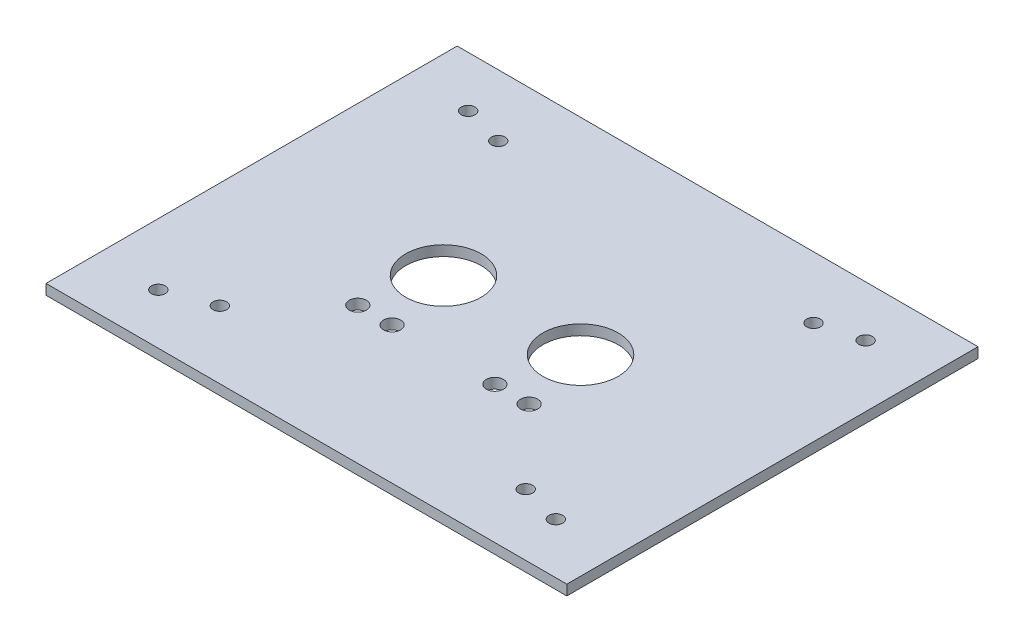
ISO-10303-21;
HEADER;
FILE_DESCRIPTION(('STEP AP214'),'2;1');
FILE_NAME('part.step','',(''),(''),'','','');
FILE_SCHEMA(('AUTOMOTIVE_DESIGN { 1 0 10303 214 1 1 1 1 }'));
ENDSEC;
DATA;
#1=APPLICATION_CONTEXT('core data for automotive mechanical design processes');
#2=APPLICATION_PROTOCOL_DEFINITION('international standard','automotive_design',2000,#1);
#3=PRODUCT_CONTEXT('',#1,'mechanical');
#4=PRODUCT('Part','Part','',(#3));
#5=PRODUCT_RELATED_PRODUCT_CATEGORY('part','',(#4));
#6=PRODUCT_DEFINITION_FORMATION('','',#4);
#7=PRODUCT_DEFINITION_CONTEXT('part definition',#1,'design');
#8=PRODUCT_DEFINITION('design','',#6,#7);
#9=PRODUCT_DEFINITION_SHAPE('','',#8);
#10=(LENGTH_UNIT() NAMED_UNIT(*) SI_UNIT(.MILLI.,.METRE.));
#11=(NAMED_UNIT(*) PLANE_ANGLE_UNIT() SI_UNIT($,.RADIAN.));
#12=(NAMED_UNIT(*) SI_UNIT($,.STERADIAN.) SOLID_ANGLE_UNIT());
#13=UNCERTAINTY_MEASURE_WITH_UNIT(LENGTH_MEASURE(1.E-05),#10,'distance_accuracy_value','');
#14=(GEOMETRIC_REPRESENTATION_CONTEXT(3) GLOBAL_UNCERTAINTY_ASSIGNED_CONTEXT((#13)) GLOBAL_UNIT_ASSIGNED_CONTEXT((#10,
#11,#12)) REPRESENTATION_CONTEXT('',''));
#15=CARTESIAN_POINT('',(0.,0.,0.));
#16=DIRECTION('',(0.,0.,1.));
#17=DIRECTION('',(1.,0.,0.));
#18=AXIS2_PLACEMENT_3D('',#15,#16,#17);
#19=CARTESIAN_POINT('',(-26.6885438978218,3.,22.2049050632911));
#20=DIRECTION('',(0.,1.,0.));
#21=DIRECTION('',(0.,0.,1.));
#22=AXIS2_PLACEMENT_3D('',#19,#20,#21);
#23=PLANE('',#22);
#24=CARTESIAN_POINT('',(107.311456102178,3.,7.40694609215854));
#25=DIRECTION('',(0.,-1.,0.));
#26=DIRECTION('',(0.,0.,-1.));
#27=AXIS2_PLACEMENT_3D('',#24,#25,#26);
#28=CIRCLE('',#27,2.);
#29=CARTESIAN_POINT('',(107.311456102178,3.,5.40694609215854));
#30=VERTEX_POINT('',#29);
#31=EDGE_CURVE('E186',#30,#30,#28,.T.);
#32=ORIENTED_EDGE('',*,*,#31,.T.);
#33=EDGE_LOOP('',(#32));
#34=FACE_BOUND('',#33,.T.);
#35=CARTESIAN_POINT('',(-8.68854389782176,3.,7.40694609215852));
#36=DIRECTION('',(0.,-1.,0.));
#37=DIRECTION('',(0.,0.,-1.));
#38=AXIS2_PLACEMENT_3D('',#35,#36,#37);
#39=CIRCLE('',#38,2.);
#40=CARTESIAN_POINT('',(-8.68854389782176,3.,5.40694609215852));
#41=VERTEX_POINT('',#40);
#42=EDGE_CURVE('E180',#41,#41,#39,.T.);
#43=ORIENTED_EDGE('',*,*,#42,.T.);
#44=EDGE_LOOP('',(#43));
#45=FACE_BOUND('',#44,.T.);
#46=CARTESIAN_POINT('',(107.311456102178,3.,-82.9971359655761));
#47=DIRECTION('',(0.,-1.,0.));
#48=DIRECTION('',(0.,0.,-1.));
#49=AXIS2_PLACEMENT_3D('',#46,#47,#48);
#50=CIRCLE('',#49,2.0000000000001);
#51=CARTESIAN_POINT('',(107.311456102178,3.,-84.9971359655762));
#52=VERTEX_POINT('',#51);
#53=EDGE_CURVE('E174',#52,#52,#50,.T.);
#54=ORIENTED_EDGE('',*,*,#53,.T.);
#55=EDGE_LOOP('',(#54));
#56=FACE_BOUND('',#55,.T.);
#57=CARTESIAN_POINT('',(95.3114561021782,3.,4.20490506329116));
#58=DIRECTION('',(0.,-1.,0.));
#59=DIRECTION('',(0.,0.,-1.));
#60=AXIS2_PLACEMENT_3D('',#57,#58,#59);
#61=CIRCLE('',#60,2.);
#62=CARTESIAN_POINT('',(95.3114561021782,3.,2.20490506329117));
#63=VERTEX_POINT('',#62);
#64=EDGE_CURVE('E168',#63,#63,#61,.T.);
#65=ORIENTED_EDGE('',*,*,#64,.T.);
#66=EDGE_LOOP('',(#65));
#67=FACE_BOUND('',#66,.T.);
#68=CARTESIAN_POINT('',(-8.68854389782176,3.,-82.997135965576));
#69=DIRECTION('',(0.,-1.,0.));
#70=DIRECTION('',(0.,0.,-1.));
#71=AXIS2_PLACEMENT_3D('',#68,#69,#70);
#72=CIRCLE('',#71,2.);
#73=CARTESIAN_POINT('',(-8.68854389782176,3.,-84.997135965576));
#74=VERTEX_POINT('',#73);
#75=EDGE_CURVE('E162',#74,#74,#72,.T.);
#76=ORIENTED_EDGE('',*,*,#75,.T.);
#77=EDGE_LOOP('',(#76));
#78=FACE_BOUND('',#77,.T.);
#79=CARTESIAN_POINT('',(3.31145610217824,3.,-79.7950949367089));
#80=DIRECTION('',(0.,-1.,0.));
#81=DIRECTION('',(0.,0.,-1.));
#82=AXIS2_PLACEMENT_3D('',#79,#80,#81);
#83=CIRCLE('',#82,2.);
#84=CARTESIAN_POINT('',(3.31145610217824,3.,-81.7950949367089));
#85=VERTEX_POINT('',#84);
#86=EDGE_CURVE('E156',#85,#85,#83,.T.);
#87=ORIENTED_EDGE('',*,*,#86,.T.);
#88=EDGE_LOOP('',(#87));
#89=FACE_BOUND('',#88,.T.);
#90=CARTESIAN_POINT('',(95.3114561021782,3.,-79.7950949367088));
#91=DIRECTION('',(0.,-1.,0.));
#92=DIRECTION('',(0.,0.,-1.));
#93=AXIS2_PLACEMENT_3D('',#90,#91,#92);
#94=CIRCLE('',#93,2.);
#95=CARTESIAN_POINT('',(95.3114561021782,3.,-81.7950949367088));
#96=VERTEX_POINT('',#95);
#97=EDGE_CURVE('E150',#96,#96,#94,.T.);
#98=ORIENTED_EDGE('',*,*,#97,.T.);
#99=EDGE_LOOP('',(#98));
#100=FACE_BOUND('',#99,.T.);
#101=CARTESIAN_POINT('',(4.32784020325498,3.,2.48241751353112));
#102=DIRECTION('',(0.,-1.,0.));
#103=DIRECTION('',(0.,0.,-1.));
#104=AXIS2_PLACEMENT_3D('',#101,#102,#103);
#105=CIRCLE('',#104,2.);
#106=CARTESIAN_POINT('',(4.32784020325498,3.,0.482417513531124));
#107=VERTEX_POINT('',#106);
#108=EDGE_CURVE('E144',#107,#107,#105,.T.);
#109=ORIENTED_EDGE('',*,*,#108,.T.);
#110=EDGE_LOOP('',(#109));
#111=FACE_BOUND('',#110,.T.);
#112=CARTESIAN_POINT('',(29.3114561021782,3.,-37.7950949367089));
#113=DIRECTION('',(0.,1.,0.));
#114=DIRECTION('',(0.,0.,1.));
#115=AXIS2_PLACEMENT_3D('',#112,#113,#114);
#116=CIRCLE('',#115,11.);
#117=CARTESIAN_POINT('',(29.3114561021782,3.,-26.7950949367089));
#118=VERTEX_POINT('',#117);
#119=EDGE_CURVE('E132',#118,#118,#116,.T.);
#120=ORIENTED_EDGE('',*,*,#119,.F.);
#121=EDGE_LOOP('',(#120));
#122=FACE_BOUND('',#121,.T.);
#123=CARTESIAN_POINT('',(64.3114561021782,3.,-17.7950949367089));
#124=DIRECTION('',(0.,1.,0.));
#125=DIRECTION('',(0.,0.,1.));
#126=AXIS2_PLACEMENT_3D('',#123,#124,#125);
#127=CIRCLE('',#126,2.49999999999999);
#128=CARTESIAN_POINT('',(64.3114561021782,3.,-15.2950949367089));
#129=VERTEX_POINT('',#128);
#130=EDGE_CURVE('E120',#129,#129,#127,.T.);
#131=ORIENTED_EDGE('',*,*,#130,.F.);
#132=EDGE_LOOP('',(#131));
#133=FACE_BOUND('',#132,.T.);
#134=CARTESIAN_POINT('',(24.3114561021782,3.,-17.7950949367089));
#135=DIRECTION('',(0.,1.,0.));
#136=DIRECTION('',(0.,0.,1.));
#137=AXIS2_PLACEMENT_3D('',#134,#135,#136);
#138=CIRCLE('',#137,2.5);
#139=CARTESIAN_POINT('',(24.3114561021782,3.,-15.2950949367089));
#140=VERTEX_POINT('',#139);
#141=EDGE_CURVE('E99',#140,#140,#138,.T.);
#142=ORIENTED_EDGE('',*,*,#141,.F.);
#143=EDGE_LOOP('',(#142));
#144=FACE_BOUND('',#143,.T.);
#145=DIRECTION('',(0.,0.,1.));
#146=VECTOR('',#145,1.);
#147=CARTESIAN_POINT('',(-26.6885438978218,3.,-97.7950949367089));
#148=LINE('',#147,#146);
#149=CARTESIAN_POINT('',(-26.6885438978218,3.,-97.7950949367089));
#150=VERTEX_POINT('',#149);
#151=CARTESIAN_POINT('',(-26.6885438978218,3.,22.2049050632911));
#152=VERTEX_POINT('',#151);
#153=EDGE_CURVE('E84',#150,#152,#148,.T.);
#154=ORIENTED_EDGE('',*,*,#153,.T.);
#155=DIRECTION('',(1.,0.,0.));
#156=VECTOR('',#155,1.);
#157=CARTESIAN_POINT('',(-26.6885438978218,3.,22.2049050632911));
#158=LINE('',#157,#156);
#159=CARTESIAN_POINT('',(125.311456102178,3.,22.2049050632911));
#160=VERTEX_POINT('',#159);
#161=EDGE_CURVE('E79',#152,#160,#158,.T.);
#162=ORIENTED_EDGE('',*,*,#161,.T.);
#163=DIRECTION('',(0.,0.,-1.));
#164=VECTOR('',#163,1.);
#165=CARTESIAN_POINT('',(125.311456102178,3.,-97.7950949367089));
#166=LINE('',#165,#164);
#167=CARTESIAN_POINT('',(125.311456102178,3.,-97.7950949367089));
#168=VERTEX_POINT('',#167);
#169=EDGE_CURVE('E82',#160,#168,#166,.T.);
#170=ORIENTED_EDGE('',*,*,#169,.T.);
#171=DIRECTION('',(-1.,0.,0.));
#172=VECTOR('',#171,1.);
#173=CARTESIAN_POINT('',(-26.6885438978218,3.,-97.7950949367089));
#174=LINE('',#173,#172);
#175=EDGE_CURVE('E49',#168,#150,#174,.T.);
#176=ORIENTED_EDGE('',*,*,#175,.T.);
#177=EDGE_LOOP('',(#154,#162,#170,#176));
#178=FACE_BOUND('',#177,.T.);
#179=CARTESIAN_POINT('',(34.3114561021782,3.,-17.7950949367089));
#180=DIRECTION('',(0.,1.,0.));
#181=DIRECTION('',(0.,0.,1.));
#182=AXIS2_PLACEMENT_3D('',#179,#180,#181);
#183=CIRCLE('',#182,2.49999999999999);
#184=CARTESIAN_POINT('',(34.3114561021782,3.,-15.2950949367089));
#185=VERTEX_POINT('',#184);
#186=EDGE_CURVE('E114',#185,#185,#183,.T.);
#187=ORIENTED_EDGE('',*,*,#186,.F.);
#188=EDGE_LOOP('',(#187));
#189=FACE_BOUND('',#188,.T.);
#190=CARTESIAN_POINT('',(74.3114561021782,3.,-17.7950949367089));
#191=DIRECTION('',(0.,1.,0.));
#192=DIRECTION('',(0.,0.,1.));
#193=AXIS2_PLACEMENT_3D('',#190,#191,#192);
#194=CIRCLE('',#193,2.49999999999999);
#195=CARTESIAN_POINT('',(74.3114561021782,3.,-15.2950949367089));
#196=VERTEX_POINT('',#195);
#197=EDGE_CURVE('E126',#196,#196,#194,.T.);
#198=ORIENTED_EDGE('',*,*,#197,.F.);
#199=EDGE_LOOP('',(#198));
#200=FACE_BOUND('',#199,.T.);
#201=CARTESIAN_POINT('',(69.3114561021782,3.,-37.7950949367089));
#202=DIRECTION('',(0.,1.,0.));
#203=DIRECTION('',(0.,0.,1.));
#204=AXIS2_PLACEMENT_3D('',#201,#202,#203);
#205=CIRCLE('',#204,11.);
#206=CARTESIAN_POINT('',(69.3114561021782,3.,-26.7950949367089));
#207=VERTEX_POINT('',#206);
#208=EDGE_CURVE('E138',#207,#207,#205,.T.);
#209=ORIENTED_EDGE('',*,*,#208,.F.);
#210=EDGE_LOOP('',(#209));
#211=FACE_BOUND('',#210,.T.);
#212=ADVANCED_FACE('F32',(#34,#45,#56,#67,#78,#89,#100,#111,#122,#133,#144,#178,#189,#200,#211),
#23,.T.);
#213=CARTESIAN_POINT('',(-26.6885438978218,0.,22.2049050632911));
#214=DIRECTION('',(0.,1.,0.));
#215=DIRECTION('',(0.,0.,1.));
#216=AXIS2_PLACEMENT_3D('',#213,#214,#215);
#217=PLANE('',#216);
#218=CARTESIAN_POINT('',(107.311456102178,0.,7.40694609215854));
#219=DIRECTION('',(0.,-1.,0.));
#220=DIRECTION('',(0.,0.,-1.));
#221=AXIS2_PLACEMENT_3D('',#218,#219,#220);
#222=CIRCLE('',#221,2.);
#223=CARTESIAN_POINT('',(107.311456102178,0.,5.40694609215854));
#224=VERTEX_POINT('',#223);
#225=EDGE_CURVE('E189',#224,#224,#222,.T.);
#226=ORIENTED_EDGE('',*,*,#225,.F.);
#227=EDGE_LOOP('',(#226));
#228=FACE_BOUND('',#227,.T.);
#229=CARTESIAN_POINT('',(-8.68854389782176,0.,7.40694609215852));
#230=DIRECTION('',(0.,-1.,0.));
#231=DIRECTION('',(0.,0.,-1.));
#232=AXIS2_PLACEMENT_3D('',#229,#230,#231);
#233=CIRCLE('',#232,2.);
#234=CARTESIAN_POINT('',(-8.68854389782176,0.,5.40694609215852));
#235=VERTEX_POINT('',#234);
#236=EDGE_CURVE('E183',#235,#235,#233,.T.);
#237=ORIENTED_EDGE('',*,*,#236,.F.);
#238=EDGE_LOOP('',(#237));
#239=FACE_BOUND('',#238,.T.);
#240=CARTESIAN_POINT('',(107.311456102178,0.,-82.9971359655761));
#241=DIRECTION('',(0.,-1.,0.));
#242=DIRECTION('',(0.,0.,-1.));
#243=AXIS2_PLACEMENT_3D('',#240,#241,#242);
#244=CIRCLE('',#243,2.0000000000001);
#245=CARTESIAN_POINT('',(107.311456102178,0.,-84.9971359655762));
#246=VERTEX_POINT('',#245);
#247=EDGE_CURVE('E177',#246,#246,#244,.T.);
#248=ORIENTED_EDGE('',*,*,#247,.F.);
#249=EDGE_LOOP('',(#248));
#250=FACE_BOUND('',#249,.T.);
#251=CARTESIAN_POINT('',(95.3114561021782,0.,4.20490506329116));
#252=DIRECTION('',(0.,-1.,0.));
#253=DIRECTION('',(0.,0.,-1.));
#254=AXIS2_PLACEMENT_3D('',#251,#252,#253);
#255=CIRCLE('',#254,2.);
#256=CARTESIAN_POINT('',(95.3114561021782,0.,2.20490506329117));
#257=VERTEX_POINT('',#256);
#258=EDGE_CURVE('E171',#257,#257,#255,.T.);
#259=ORIENTED_EDGE('',*,*,#258,.F.);
#260=EDGE_LOOP('',(#259));
#261=FACE_BOUND('',#260,.T.);
#262=CARTESIAN_POINT('',(-8.68854389782176,0.,-82.997135965576));
#263=DIRECTION('',(0.,-1.,0.));
#264=DIRECTION('',(0.,0.,-1.));
#265=AXIS2_PLACEMENT_3D('',#262,#263,#264);
#266=CIRCLE('',#265,2.);
#267=CARTESIAN_POINT('',(-8.68854389782176,0.,-84.997135965576));
#268=VERTEX_POINT('',#267);
#269=EDGE_CURVE('E165',#268,#268,#266,.T.);
#270=ORIENTED_EDGE('',*,*,#269,.F.);
#271=EDGE_LOOP('',(#270));
#272=FACE_BOUND('',#271,.T.);
#273=CARTESIAN_POINT('',(3.31145610217824,0.,-79.7950949367089));
#274=DIRECTION('',(0.,-1.,0.));
#275=DIRECTION('',(0.,0.,-1.));
#276=AXIS2_PLACEMENT_3D('',#273,#274,#275);
#277=CIRCLE('',#276,2.);
#278=CARTESIAN_POINT('',(3.31145610217824,0.,-81.7950949367089));
#279=VERTEX_POINT('',#278);
#280=EDGE_CURVE('E159',#279,#279,#277,.T.);
#281=ORIENTED_EDGE('',*,*,#280,.F.);
#282=EDGE_LOOP('',(#281));
#283=FACE_BOUND('',#282,.T.);
#284=CARTESIAN_POINT('',(95.3114561021782,0.,-79.7950949367088));
#285=DIRECTION('',(0.,-1.,0.));
#286=DIRECTION('',(0.,0.,-1.));
#287=AXIS2_PLACEMENT_3D('',#284,#285,#286);
#288=CIRCLE('',#287,2.);
#289=CARTESIAN_POINT('',(95.3114561021782,0.,-81.7950949367088));
#290=VERTEX_POINT('',#289);
#291=EDGE_CURVE('E153',#290,#290,#288,.T.);
#292=ORIENTED_EDGE('',*,*,#291,.F.);
#293=EDGE_LOOP('',(#292));
#294=FACE_BOUND('',#293,.T.);
#295=CARTESIAN_POINT('',(4.32784020325498,0.,2.48241751353112));
#296=DIRECTION('',(0.,-1.,0.));
#297=DIRECTION('',(0.,0.,-1.));
#298=AXIS2_PLACEMENT_3D('',#295,#296,#297);
#299=CIRCLE('',#298,2.);
#300=CARTESIAN_POINT('',(4.32784020325498,0.,0.482417513531124));
#301=VERTEX_POINT('',#300);
#302=EDGE_CURVE('E147',#301,#301,#299,.T.);
#303=ORIENTED_EDGE('',*,*,#302,.F.);
#304=EDGE_LOOP('',(#303));
#305=FACE_BOUND('',#304,.T.);
#306=CARTESIAN_POINT('',(29.3114561021782,0.,-37.7950949367089));
#307=DIRECTION('',(0.,1.,0.));
#308=DIRECTION('',(0.,0.,1.));
#309=AXIS2_PLACEMENT_3D('',#306,#307,#308);
#310=CIRCLE('',#309,11.);
#311=CARTESIAN_POINT('',(29.3114561021782,0.,-26.7950949367089));
#312=VERTEX_POINT('',#311);
#313=EDGE_CURVE('E135',#312,#312,#310,.T.);
#314=ORIENTED_EDGE('',*,*,#313,.T.);
#315=EDGE_LOOP('',(#314));
#316=FACE_BOUND('',#315,.T.);
#317=CARTESIAN_POINT('',(64.3114561021782,0.,-17.7950949367089));
#318=DIRECTION('',(0.,1.,0.));
#319=DIRECTION('',(0.,0.,1.));
#320=AXIS2_PLACEMENT_3D('',#317,#318,#319);
#321=CIRCLE('',#320,2.49999999999999);
#322=CARTESIAN_POINT('',(64.3114561021782,0.,-15.2950949367089));
#323=VERTEX_POINT('',#322);
#324=EDGE_CURVE('E123',#323,#323,#321,.T.);
#325=ORIENTED_EDGE('',*,*,#324,.T.);
#326=EDGE_LOOP('',(#325));
#327=FACE_BOUND('',#326,.T.);
#328=CARTESIAN_POINT('',(24.3114561021782,0.,-17.7950949367089));
#329=DIRECTION('',(0.,1.,0.));
#330=DIRECTION('',(0.,0.,1.));
#331=AXIS2_PLACEMENT_3D('',#328,#329,#330);
#332=CIRCLE('',#331,2.5);
#333=CARTESIAN_POINT('',(24.3114561021782,0.,-15.2950949367089));
#334=VERTEX_POINT('',#333);
#335=EDGE_CURVE('E111',#334,#334,#332,.T.);
#336=ORIENTED_EDGE('',*,*,#335,.T.);
#337=EDGE_LOOP('',(#336));
#338=FACE_BOUND('',#337,.T.);
#339=DIRECTION('',(0.,0.,1.));
#340=VECTOR('',#339,1.);
#341=CARTESIAN_POINT('',(-26.6885438978218,0.,-97.7950949367089));
#342=LINE('',#341,#340);
#343=CARTESIAN_POINT('',(-26.6885438978218,0.,-97.7950949367089));
#344=VERTEX_POINT('',#343);
#345=CARTESIAN_POINT('',(-26.6885438978218,0.,22.2049050632911));
#346=VERTEX_POINT('',#345);
#347=EDGE_CURVE('E96',#344,#346,#342,.T.);
#348=ORIENTED_EDGE('',*,*,#347,.F.);
#349=DIRECTION('',(-1.,0.,0.));
#350=VECTOR('',#349,1.);
#351=CARTESIAN_POINT('',(-26.6885438978218,0.,-97.7950949367089));
#352=LINE('',#351,#350);
#353=CARTESIAN_POINT('',(125.311456102178,0.,-97.7950949367089));
#354=VERTEX_POINT('',#353);
#355=EDGE_CURVE('E72',#354,#344,#352,.T.);
#356=ORIENTED_EDGE('',*,*,#355,.F.);
#357=DIRECTION('',(0.,0.,-1.));
#358=VECTOR('',#357,1.);
#359=CARTESIAN_POINT('',(125.311456102178,0.,-97.7950949367089));
#360=LINE('',#359,#358);
#361=CARTESIAN_POINT('',(125.311456102178,0.,22.2049050632911));
#362=VERTEX_POINT('',#361);
#363=EDGE_CURVE('E66',#362,#354,#360,.T.);
#364=ORIENTED_EDGE('',*,*,#363,.F.);
#365=DIRECTION('',(1.,0.,0.));
#366=VECTOR('',#365,1.);
#367=CARTESIAN_POINT('',(-26.6885438978218,0.,22.2049050632911));
#368=LINE('',#367,#366);
#369=EDGE_CURVE('E88',#346,#362,#368,.T.);
#370=ORIENTED_EDGE('',*,*,#369,.F.);
#371=EDGE_LOOP('',(#348,#356,#364,#370));
#372=FACE_BOUND('',#371,.T.);
#373=CARTESIAN_POINT('',(34.3114561021782,0.,-17.7950949367089));
#374=DIRECTION('',(0.,1.,0.));
#375=DIRECTION('',(0.,0.,1.));
#376=AXIS2_PLACEMENT_3D('',#373,#374,#375);
#377=CIRCLE('',#376,2.49999999999999);
#378=CARTESIAN_POINT('',(34.3114561021782,0.,-15.2950949367089));
#379=VERTEX_POINT('',#378);
#380=EDGE_CURVE('E117',#379,#379,#377,.T.);
#381=ORIENTED_EDGE('',*,*,#380,.T.);
#382=EDGE_LOOP('',(#381));
#383=FACE_BOUND('',#382,.T.);
#384=CARTESIAN_POINT('',(74.3114561021782,0.,-17.7950949367089));
#385=DIRECTION('',(0.,1.,0.));
#386=DIRECTION('',(0.,0.,1.));
#387=AXIS2_PLACEMENT_3D('',#384,#385,#386);
#388=CIRCLE('',#387,2.49999999999999);
#389=CARTESIAN_POINT('',(74.3114561021782,0.,-15.2950949367089));
#390=VERTEX_POINT('',#389);
#391=EDGE_CURVE('E129',#390,#390,#388,.T.);
#392=ORIENTED_EDGE('',*,*,#391,.T.);
#393=EDGE_LOOP('',(#392));
#394=FACE_BOUND('',#393,.T.);
#395=CARTESIAN_POINT('',(69.3114561021782,0.,-37.7950949367089));
#396=DIRECTION('',(0.,1.,0.));
#397=DIRECTION('',(0.,0.,1.));
#398=AXIS2_PLACEMENT_3D('',#395,#396,#397);
#399=CIRCLE('',#398,11.);
#400=CARTESIAN_POINT('',(69.3114561021782,0.,-26.7950949367089));
#401=VERTEX_POINT('',#400);
#402=EDGE_CURVE('E141',#401,#401,#399,.T.);
#403=ORIENTED_EDGE('',*,*,#402,.T.);
#404=EDGE_LOOP('',(#403));
#405=FACE_BOUND('',#404,.T.);
#406=ADVANCED_FACE('F107',(#228,#239,#250,#261,#272,#283,#294,#305,#316,#327,#338,#372,#383,
#394,#405),#217,.F.);
#407=CARTESIAN_POINT('',(-26.6885438978218,3.,-97.7950949367089));
#408=DIRECTION('',(1.,0.,0.));
#409=DIRECTION('',(0.,0.,-1.));
#410=AXIS2_PLACEMENT_3D('',#407,#408,#409);
#411=PLANE('',#410);
#412=ORIENTED_EDGE('',*,*,#347,.T.);
#413=DIRECTION('',(0.,-1.,0.));
#414=VECTOR('',#413,1.);
#415=CARTESIAN_POINT('',(-26.6885438978218,3.,22.2049050632911));
#416=LINE('',#415,#414);
#417=EDGE_CURVE('E11',#152,#346,#416,.T.);
#418=ORIENTED_EDGE('',*,*,#417,.F.);
#419=ORIENTED_EDGE('',*,*,#153,.F.);
#420=DIRECTION('',(0.,-1.,0.));
#421=VECTOR('',#420,1.);
#422=CARTESIAN_POINT('',(-26.6885438978218,3.,-97.7950949367089));
#423=LINE('',#422,#421);
#424=EDGE_CURVE('E92',#150,#344,#423,.T.);
#425=ORIENTED_EDGE('',*,*,#424,.T.);
#426=EDGE_LOOP('',(#412,#418,#419,#425));
#427=FACE_BOUND('',#426,.T.);
#428=ADVANCED_FACE('F34',(#427),#411,.F.);
#429=CARTESIAN_POINT('',(-26.6885438978218,3.,22.2049050632911));
#430=DIRECTION('',(0.,0.,-1.));
#431=DIRECTION('',(-1.,0.,0.));
#432=AXIS2_PLACEMENT_3D('',#429,#430,#431);
#433=PLANE('',#432);
#434=ORIENTED_EDGE('',*,*,#369,.T.);
#435=DIRECTION('',(0.,-1.,0.));
#436=VECTOR('',#435,1.);
#437=CARTESIAN_POINT('',(125.311456102178,3.,22.2049050632911));
#438=LINE('',#437,#436);
#439=EDGE_CURVE('E41',#160,#362,#438,.T.);
#440=ORIENTED_EDGE('',*,*,#439,.F.);
#441=ORIENTED_EDGE('',*,*,#161,.F.);
#442=ORIENTED_EDGE('',*,*,#417,.T.);
#443=EDGE_LOOP('',(#434,#440,#441,#442));
#444=FACE_BOUND('',#443,.T.);
#445=ADVANCED_FACE('F87',(#444),#433,.F.);
#446=CARTESIAN_POINT('',(125.311456102178,3.,-97.7950949367089));
#447=DIRECTION('',(-1.,0.,0.));
#448=DIRECTION('',(0.,0.,1.));
#449=AXIS2_PLACEMENT_3D('',#446,#447,#448);
#450=PLANE('',#449);
#451=ORIENTED_EDGE('',*,*,#363,.T.);
#452=DIRECTION('',(0.,-1.,0.));
#453=VECTOR('',#452,1.);
#454=CARTESIAN_POINT('',(125.311456102178,3.,-97.7950949367089));
#455=LINE('',#454,#453);
#456=EDGE_CURVE('E89',#168,#354,#455,.T.);
#457=ORIENTED_EDGE('',*,*,#456,.F.);
#458=ORIENTED_EDGE('',*,*,#169,.F.);
#459=ORIENTED_EDGE('',*,*,#439,.T.);
#460=EDGE_LOOP('',(#451,#457,#458,#459));
#461=FACE_BOUND('',#460,.T.);
#462=ADVANCED_FACE('F90',(#461),#450,.F.);
#463=CARTESIAN_POINT('',(-26.6885438978218,3.,-97.7950949367089));
#464=DIRECTION('',(0.,0.,1.));
#465=DIRECTION('',(1.,0.,0.));
#466=AXIS2_PLACEMENT_3D('',#463,#464,#465);
#467=PLANE('',#466);
#468=ORIENTED_EDGE('',*,*,#355,.T.);
#469=ORIENTED_EDGE('',*,*,#424,.F.);
#470=ORIENTED_EDGE('',*,*,#175,.F.);
#471=ORIENTED_EDGE('',*,*,#456,.T.);
#472=EDGE_LOOP('',(#468,#469,#470,#471));
#473=FACE_BOUND('',#472,.T.);
#474=ADVANCED_FACE('F104',(#473),#467,.F.);
#475=CARTESIAN_POINT('',(24.3114561021782,3.,-17.7950949367089));
#476=DIRECTION('',(0.,-1.,0.));
#477=DIRECTION('',(0.,0.,-1.));
#478=AXIS2_PLACEMENT_3D('',#475,#476,#477);
#479=CYLINDRICAL_SURFACE('',#478,2.5);
#480=ORIENTED_EDGE('',*,*,#141,.T.);
#481=EDGE_LOOP('',(#480));
#482=FACE_BOUND('',#481,.T.);
#483=ORIENTED_EDGE('',*,*,#335,.F.);
#484=EDGE_LOOP('',(#483));
#485=FACE_BOUND('',#484,.T.);
#486=ADVANCED_FACE('F227',(#482,#485),#479,.F.);
#487=CARTESIAN_POINT('',(34.3114561021782,3.,-17.7950949367089));
#488=DIRECTION('',(0.,-1.,0.));
#489=DIRECTION('',(0.,0.,-1.));
#490=AXIS2_PLACEMENT_3D('',#487,#488,#489);
#491=CYLINDRICAL_SURFACE('',#490,2.49999999999999);
#492=ORIENTED_EDGE('',*,*,#186,.T.);
#493=EDGE_LOOP('',(#492));
#494=FACE_BOUND('',#493,.T.);
#495=ORIENTED_EDGE('',*,*,#380,.F.);
#496=EDGE_LOOP('',(#495));
#497=FACE_BOUND('',#496,.T.);
#498=ADVANCED_FACE('F229',(#494,#497),#491,.F.);
#499=CARTESIAN_POINT('',(64.3114561021782,3.,-17.7950949367089));
#500=DIRECTION('',(0.,-1.,0.));
#501=DIRECTION('',(0.,0.,-1.));
#502=AXIS2_PLACEMENT_3D('',#499,#500,#501);
#503=CYLINDRICAL_SURFACE('',#502,2.49999999999999);
#504=ORIENTED_EDGE('',*,*,#130,.T.);
#505=EDGE_LOOP('',(#504));
#506=FACE_BOUND('',#505,.T.);
#507=ORIENTED_EDGE('',*,*,#324,.F.);
#508=EDGE_LOOP('',(#507));
#509=FACE_BOUND('',#508,.T.);
#510=ADVANCED_FACE('F236',(#506,#509),#503,.F.);
#511=CARTESIAN_POINT('',(74.3114561021782,3.,-17.7950949367089));
#512=DIRECTION('',(0.,-1.,0.));
#513=DIRECTION('',(0.,0.,-1.));
#514=AXIS2_PLACEMENT_3D('',#511,#512,#513);
#515=CYLINDRICAL_SURFACE('',#514,2.49999999999999);
#516=ORIENTED_EDGE('',*,*,#197,.T.);
#517=EDGE_LOOP('',(#516));
#518=FACE_BOUND('',#517,.T.);
#519=ORIENTED_EDGE('',*,*,#391,.F.);
#520=EDGE_LOOP('',(#519));
#521=FACE_BOUND('',#520,.T.);
#522=ADVANCED_FACE('F351',(#518,#521),#515,.F.);
#523=CARTESIAN_POINT('',(29.3114561021782,3.,-37.7950949367089));
#524=DIRECTION('',(0.,-1.,0.));
#525=DIRECTION('',(0.,0.,-1.));
#526=AXIS2_PLACEMENT_3D('',#523,#524,#525);
#527=CYLINDRICAL_SURFACE('',#526,11.);
#528=ORIENTED_EDGE('',*,*,#119,.T.);
#529=EDGE_LOOP('',(#528));
#530=FACE_BOUND('',#529,.T.);
#531=ORIENTED_EDGE('',*,*,#313,.F.);
#532=EDGE_LOOP('',(#531));
#533=FACE_BOUND('',#532,.T.);
#534=ADVANCED_FACE('F347',(#530,#533),#527,.F.);
#535=CARTESIAN_POINT('',(69.3114561021782,3.,-37.7950949367089));
#536=DIRECTION('',(0.,-1.,0.));
#537=DIRECTION('',(0.,0.,-1.));
#538=AXIS2_PLACEMENT_3D('',#535,#536,#537);
#539=CYLINDRICAL_SURFACE('',#538,11.);
#540=ORIENTED_EDGE('',*,*,#208,.T.);
#541=EDGE_LOOP('',(#540));
#542=FACE_BOUND('',#541,.T.);
#543=ORIENTED_EDGE('',*,*,#402,.F.);
#544=EDGE_LOOP('',(#543));
#545=FACE_BOUND('',#544,.T.);
#546=ADVANCED_FACE('F272',(#542,#545),#539,.F.);
#547=CARTESIAN_POINT('',(4.32784020325498,3.,2.48241751353112));
#548=DIRECTION('',(0.,-1.,0.));
#549=DIRECTION('',(0.,0.,-1.));
#550=AXIS2_PLACEMENT_3D('',#547,#548,#549);
#551=CYLINDRICAL_SURFACE('',#550,2.);
#552=ORIENTED_EDGE('',*,*,#108,.F.);
#553=EDGE_LOOP('',(#552));
#554=FACE_BOUND('',#553,.T.);
#555=ORIENTED_EDGE('',*,*,#302,.T.);
#556=EDGE_LOOP('',(#555));
#557=FACE_BOUND('',#556,.T.);
#558=ADVANCED_FACE('F266',(#554,#557),#551,.F.);
#559=CARTESIAN_POINT('',(95.3114561021782,3.,-79.7950949367088));
#560=DIRECTION('',(0.,-1.,0.));
#561=DIRECTION('',(0.,0.,-1.));
#562=AXIS2_PLACEMENT_3D('',#559,#560,#561);
#563=CYLINDRICAL_SURFACE('',#562,2.);
#564=ORIENTED_EDGE('',*,*,#97,.F.);
#565=EDGE_LOOP('',(#564));
#566=FACE_BOUND('',#565,.T.);
#567=ORIENTED_EDGE('',*,*,#291,.T.);
#568=EDGE_LOOP('',(#567));
#569=FACE_BOUND('',#568,.T.);
#570=ADVANCED_FACE('F271',(#566,#569),#563,.F.);
#571=CARTESIAN_POINT('',(3.31145610217824,3.,-79.7950949367089));
#572=DIRECTION('',(0.,-1.,0.));
#573=DIRECTION('',(0.,0.,-1.));
#574=AXIS2_PLACEMENT_3D('',#571,#572,#573);
#575=CYLINDRICAL_SURFACE('',#574,2.);
#576=ORIENTED_EDGE('',*,*,#86,.F.);
#577=EDGE_LOOP('',(#576));
#578=FACE_BOUND('',#577,.T.);
#579=ORIENTED_EDGE('',*,*,#280,.T.);
#580=EDGE_LOOP('',(#579));
#581=FACE_BOUND('',#580,.T.);
#582=ADVANCED_FACE('F284',(#578,#581),#575,.F.);
#583=CARTESIAN_POINT('',(-8.68854389782176,3.,-82.997135965576));
#584=DIRECTION('',(0.,-1.,0.));
#585=DIRECTION('',(0.,0.,-1.));
#586=AXIS2_PLACEMENT_3D('',#583,#584,#585);
#587=CYLINDRICAL_SURFACE('',#586,2.);
#588=ORIENTED_EDGE('',*,*,#75,.F.);
#589=EDGE_LOOP('',(#588));
#590=FACE_BOUND('',#589,.T.);
#591=ORIENTED_EDGE('',*,*,#269,.T.);
#592=EDGE_LOOP('',(#591));
#593=FACE_BOUND('',#592,.T.);
#594=ADVANCED_FACE('F294',(#590,#593),#587,.F.);
#595=CARTESIAN_POINT('',(95.3114561021782,3.,4.20490506329116));
#596=DIRECTION('',(0.,-1.,0.));
#597=DIRECTION('',(0.,0.,-1.));
#598=AXIS2_PLACEMENT_3D('',#595,#596,#597);
#599=CYLINDRICAL_SURFACE('',#598,2.);
#600=ORIENTED_EDGE('',*,*,#64,.F.);
#601=EDGE_LOOP('',(#600));
#602=FACE_BOUND('',#601,.T.);
#603=ORIENTED_EDGE('',*,*,#258,.T.);
#604=EDGE_LOOP('',(#603));
#605=FACE_BOUND('',#604,.T.);
#606=ADVANCED_FACE('F304',(#602,#605),#599,.F.);
#607=CARTESIAN_POINT('',(107.311456102178,3.,-82.9971359655761));
#608=DIRECTION('',(0.,-1.,0.));
#609=DIRECTION('',(0.,0.,-1.));
#610=AXIS2_PLACEMENT_3D('',#607,#608,#609);
#611=CYLINDRICAL_SURFACE('',#610,2.0000000000001);
#612=ORIENTED_EDGE('',*,*,#53,.F.);
#613=EDGE_LOOP('',(#612));
#614=FACE_BOUND('',#613,.T.);
#615=ORIENTED_EDGE('',*,*,#247,.T.);
#616=EDGE_LOOP('',(#615));
#617=FACE_BOUND('',#616,.T.);
#618=ADVANCED_FACE('F314',(#614,#617),#611,.F.);
#619=CARTESIAN_POINT('',(-8.68854389782176,3.,7.40694609215852));
#620=DIRECTION('',(0.,-1.,0.));
#621=DIRECTION('',(0.,0.,-1.));
#622=AXIS2_PLACEMENT_3D('',#619,#620,#621);
#623=CYLINDRICAL_SURFACE('',#622,2.);
#624=ORIENTED_EDGE('',*,*,#42,.F.);
#625=EDGE_LOOP('',(#624));
#626=FACE_BOUND('',#625,.T.);
#627=ORIENTED_EDGE('',*,*,#236,.T.);
#628=EDGE_LOOP('',(#627));
#629=FACE_BOUND('',#628,.T.);
#630=ADVANCED_FACE('F200',(#626,#629),#623,.F.);
#631=CARTESIAN_POINT('',(107.311456102178,3.,7.40694609215854));
#632=DIRECTION('',(0.,-1.,0.));
#633=DIRECTION('',(0.,0.,-1.));
#634=AXIS2_PLACEMENT_3D('',#631,#632,#633);
#635=CYLINDRICAL_SURFACE('',#634,2.);
#636=ORIENTED_EDGE('',*,*,#31,.F.);
#637=EDGE_LOOP('',(#636));
#638=FACE_BOUND('',#637,.T.);
#639=ORIENTED_EDGE('',*,*,#225,.T.);
#640=EDGE_LOOP('',(#639));
#641=FACE_BOUND('',#640,.T.);
#642=ADVANCED_FACE('F197',(#638,#641),#635,.F.);
#643=CLOSED_SHELL('',(#212,#406,#428,#445,#462,#474,#486,#498,#510,#522,#534,#546,#558,#570,
#582,#594,#606,#618,#630,#642));
#644=MANIFOLD_SOLID_BREP('B2',#643);
#645=ADVANCED_BREP_SHAPE_REPRESENTATION('',(#18,#644),#14);
#646=SHAPE_DEFINITION_REPRESENTATION(#9,#645);
ENDSEC;
END-ISO-10303-21;
